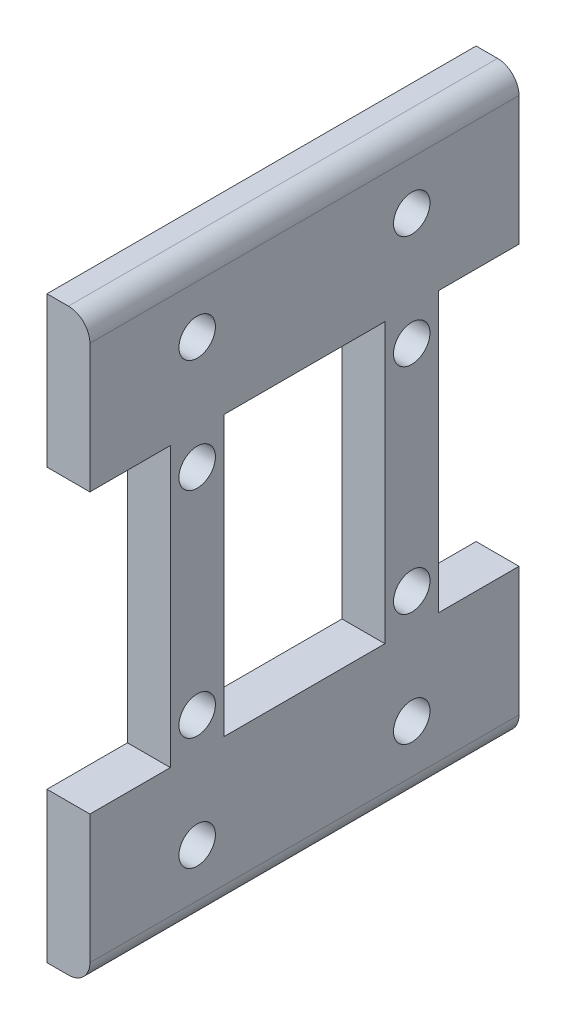
ISO-10303-21;
HEADER;
FILE_DESCRIPTION(('STEP AP214'),'2;1');
FILE_NAME('part.step','',(''),(''),'','','');
FILE_SCHEMA(('AUTOMOTIVE_DESIGN { 1 0 10303 214 1 1 1 1 }'));
ENDSEC;
DATA;
#1=APPLICATION_CONTEXT('core data for automotive mechanical design processes');
#2=APPLICATION_PROTOCOL_DEFINITION('international standard','automotive_design',2000,#1);
#3=PRODUCT_CONTEXT('',#1,'mechanical');
#4=PRODUCT('Part','Part','',(#3));
#5=PRODUCT_RELATED_PRODUCT_CATEGORY('part','',(#4));
#6=PRODUCT_DEFINITION_FORMATION('','',#4);
#7=PRODUCT_DEFINITION_CONTEXT('part definition',#1,'design');
#8=PRODUCT_DEFINITION('design','',#6,#7);
#9=PRODUCT_DEFINITION_SHAPE('','',#8);
#10=(LENGTH_UNIT() NAMED_UNIT(*) SI_UNIT(.MILLI.,.METRE.));
#11=(NAMED_UNIT(*) PLANE_ANGLE_UNIT() SI_UNIT($,.RADIAN.));
#12=(NAMED_UNIT(*) SI_UNIT($,.STERADIAN.) SOLID_ANGLE_UNIT());
#13=UNCERTAINTY_MEASURE_WITH_UNIT(LENGTH_MEASURE(1.E-05),#10,'distance_accuracy_value','');
#14=(GEOMETRIC_REPRESENTATION_CONTEXT(3) GLOBAL_UNCERTAINTY_ASSIGNED_CONTEXT((#13)) GLOBAL_UNIT_ASSIGNED_CONTEXT((#10,
#11,#12)) REPRESENTATION_CONTEXT('',''));
#15=CARTESIAN_POINT('',(0.,0.,0.));
#16=DIRECTION('',(0.,0.,1.));
#17=DIRECTION('',(1.,0.,0.));
#18=AXIS2_PLACEMENT_3D('',#15,#16,#17);
#19=CARTESIAN_POINT('',(-28.4226569673589,19.6378058506293,-42.091224183858));
#20=DIRECTION('',(-1.,0.,0.));
#21=DIRECTION('',(0.,0.,1.));
#22=AXIS2_PLACEMENT_3D('',#19,#20,#21);
#23=PLANE('',#22);
#24=DIRECTION('',(0.,0.,-1.));
#25=VECTOR('',#24,1.);
#26=CARTESIAN_POINT('',(-28.4226569673589,-26.0821941493707,15.068775816142));
#27=LINE('',#26,#25);
#28=CARTESIAN_POINT('',(-28.4226569673589,-26.0821941493707,-0.80622418385801));
#29=VERTEX_POINT('',#28);
#30=CARTESIAN_POINT('',(-28.4226569673589,-26.0821941493707,-19.856224183858));
#31=VERTEX_POINT('',#30);
#32=EDGE_CURVE('E250',#29,#31,#27,.T.);
#33=ORIENTED_EDGE('',*,*,#32,.F.);
#34=DIRECTION('',(0.,-1.,0.));
#35=VECTOR('',#34,1.);
#36=CARTESIAN_POINT('',(-28.4226569673589,12.0178058506293,-0.806224183858015));
#37=LINE('',#36,#35);
#38=CARTESIAN_POINT('',(-28.4226569673589,6.93780585062928,-0.806224183858017));
#39=VERTEX_POINT('',#38);
#40=EDGE_CURVE('E285',#39,#29,#37,.T.);
#41=ORIENTED_EDGE('',*,*,#40,.F.);
#42=DIRECTION('',(0.,0.,1.));
#43=VECTOR('',#42,1.);
#44=CARTESIAN_POINT('',(-28.4226569673589,6.93780585062928,15.068775816142));
#45=LINE('',#44,#43);
#46=CARTESIAN_POINT('',(-28.4226569673589,6.93780585062928,-19.856224183858));
#47=VERTEX_POINT('',#46);
#48=EDGE_CURVE('E192',#47,#39,#45,.T.);
#49=ORIENTED_EDGE('',*,*,#48,.F.);
#50=DIRECTION('',(0.,1.,0.));
#51=VECTOR('',#50,1.);
#52=CARTESIAN_POINT('',(-28.4226569673589,-31.1621941493707,-19.856224183858));
#53=LINE('',#52,#51);
#54=EDGE_CURVE('E294',#31,#47,#53,.T.);
#55=ORIENTED_EDGE('',*,*,#54,.F.);
#56=EDGE_LOOP('',(#33,#41,#49,#55));
#57=FACE_BOUND('',#56,.T.);
#58=CARTESIAN_POINT('',(-28.4226569673589,-35.6071941493707,-23.031224183858));
#59=DIRECTION('',(-1.,0.,0.));
#60=DIRECTION('',(0.,0.,1.));
#61=AXIS2_PLACEMENT_3D('',#58,#59,#60);
#62=CIRCLE('',#61,2.159);
#63=CARTESIAN_POINT('',(-28.4226569673589,-35.6071941493707,-20.872224183858));
#64=VERTEX_POINT('',#63);
#65=EDGE_CURVE('E245',#64,#64,#62,.F.);
#66=ORIENTED_EDGE('',*,*,#65,.F.);
#67=EDGE_LOOP('',(#66));
#68=FACE_BOUND('',#67,.T.);
#69=CARTESIAN_POINT('',(-28.4226569673589,-35.6071941493707,2.36877581614199));
#70=DIRECTION('',(-1.,0.,0.));
#71=DIRECTION('',(0.,0.,1.));
#72=AXIS2_PLACEMENT_3D('',#69,#70,#71);
#73=CIRCLE('',#72,2.159);
#74=CARTESIAN_POINT('',(-28.4226569673589,-35.6071941493707,4.527775816142));
#75=VERTEX_POINT('',#74);
#76=EDGE_CURVE('E241',#75,#75,#73,.F.);
#77=ORIENTED_EDGE('',*,*,#76,.F.);
#78=EDGE_LOOP('',(#77));
#79=FACE_BOUND('',#78,.T.);
#80=CARTESIAN_POINT('',(-28.4226569673589,-26.0821941493707,15.068775816142));
#81=VERTEX_POINT('',#80);
#82=CARTESIAN_POINT('',(-28.4226569673589,-26.0821941493707,5.54377581614199));
#83=VERTEX_POINT('',#82);
#84=EDGE_CURVE('E191',#81,#83,#27,.T.);
#85=ORIENTED_EDGE('',*,*,#84,.F.);
#86=DIRECTION('',(0.,-1.,0.));
#87=VECTOR('',#86,1.);
#88=CARTESIAN_POINT('',(-28.4226569673589,-31.1621941493707,15.068775816142));
#89=LINE('',#88,#87);
#90=CARTESIAN_POINT('',(-28.4226569673589,-41.3221941493707,15.068775816142));
#91=VERTEX_POINT('',#90);
#92=EDGE_CURVE('E260',#81,#91,#89,.T.);
#93=ORIENTED_EDGE('',*,*,#92,.T.);
#94=DIRECTION('',(0.,0.,-1.));
#95=VECTOR('',#94,1.);
#96=CARTESIAN_POINT('',(-28.4226569673589,-41.3221941493707,-35.731224183858));
#97=LINE('',#96,#95);
#98=CARTESIAN_POINT('',(-28.4226569673589,-41.3221941493707,-35.731224183858));
#99=VERTEX_POINT('',#98);
#100=EDGE_CURVE('E358',#91,#99,#97,.T.);
#101=ORIENTED_EDGE('',*,*,#100,.T.);
#102=DIRECTION('',(0.,1.,0.));
#103=VECTOR('',#102,1.);
#104=CARTESIAN_POINT('',(-28.4226569673589,-43.8621941493707,-35.731224183858));
#105=LINE('',#104,#103);
#106=CARTESIAN_POINT('',(-28.4226569673589,-26.0821941493707,-35.731224183858));
#107=VERTEX_POINT('',#106);
#108=EDGE_CURVE('E330',#99,#107,#105,.T.);
#109=ORIENTED_EDGE('',*,*,#108,.T.);
#110=CARTESIAN_POINT('',(-28.4226569673589,-26.0821941493707,-26.206224183858));
#111=VERTEX_POINT('',#110);
#112=EDGE_CURVE('E71',#111,#107,#27,.T.);
#113=ORIENTED_EDGE('',*,*,#112,.F.);
#114=DIRECTION('',(0.,1.,0.));
#115=VECTOR('',#114,1.);
#116=CARTESIAN_POINT('',(-28.4226569673589,-31.1621941493707,-26.206224183858));
#117=LINE('',#116,#115);
#118=CARTESIAN_POINT('',(-28.4226569673589,6.93780585062928,-26.206224183858));
#119=VERTEX_POINT('',#118);
#120=EDGE_CURVE('E332',#111,#119,#117,.T.);
#121=ORIENTED_EDGE('',*,*,#120,.T.);
#122=CARTESIAN_POINT('',(-28.4226569673589,6.93780585062928,-35.731224183858));
#123=VERTEX_POINT('',#122);
#124=EDGE_CURVE('E194',#123,#119,#45,.T.);
#125=ORIENTED_EDGE('',*,*,#124,.F.);
#126=DIRECTION('',(0.,1.,0.));
#127=VECTOR('',#126,1.);
#128=CARTESIAN_POINT('',(-28.4226569673589,12.0178058506293,-35.731224183858));
#129=LINE('',#128,#127);
#130=CARTESIAN_POINT('',(-28.4226569673589,22.1778058506293,-35.731224183858));
#131=VERTEX_POINT('',#130);
#132=EDGE_CURVE('E334',#123,#131,#129,.T.);
#133=ORIENTED_EDGE('',*,*,#132,.T.);
#134=DIRECTION('',(0.,0.,1.));
#135=VECTOR('',#134,1.);
#136=CARTESIAN_POINT('',(-28.4226569673589,22.1778058506293,15.068775816142));
#137=LINE('',#136,#135);
#138=CARTESIAN_POINT('',(-28.4226569673589,22.1778058506293,15.068775816142));
#139=VERTEX_POINT('',#138);
#140=EDGE_CURVE('E178',#131,#139,#137,.T.);
#141=ORIENTED_EDGE('',*,*,#140,.T.);
#142=DIRECTION('',(0.,-1.,0.));
#143=VECTOR('',#142,1.);
#144=CARTESIAN_POINT('',(-28.4226569673589,24.7178058506293,15.068775816142));
#145=LINE('',#144,#143);
#146=CARTESIAN_POINT('',(-28.4226569673589,6.93780585062928,15.068775816142));
#147=VERTEX_POINT('',#146);
#148=EDGE_CURVE('E174',#139,#147,#145,.T.);
#149=ORIENTED_EDGE('',*,*,#148,.T.);
#150=CARTESIAN_POINT('',(-28.4226569673589,6.93780585062928,5.54377581614199));
#151=VERTEX_POINT('',#150);
#152=EDGE_CURVE('E64',#151,#147,#45,.T.);
#153=ORIENTED_EDGE('',*,*,#152,.F.);
#154=DIRECTION('',(0.,-1.,0.));
#155=VECTOR('',#154,1.);
#156=CARTESIAN_POINT('',(-28.4226569673589,12.0178058506293,5.54377581614199));
#157=LINE('',#156,#155);
#158=EDGE_CURVE('E182',#151,#83,#157,.T.);
#159=ORIENTED_EDGE('',*,*,#158,.T.);
#160=EDGE_LOOP('',(#85,#93,#101,#109,#113,#121,#125,#133,#141,#149,#153,#159));
#161=FACE_BOUND('',#160,.T.);
#162=CARTESIAN_POINT('',(-28.4226569673589,16.4628058506293,2.36877581614198));
#163=DIRECTION('',(-1.,0.,0.));
#164=DIRECTION('',(0.,0.,1.));
#165=AXIS2_PLACEMENT_3D('',#162,#163,#164);
#166=CIRCLE('',#165,2.159);
#167=CARTESIAN_POINT('',(-28.4226569673589,16.4628058506293,4.52777581614198));
#168=VERTEX_POINT('',#167);
#169=EDGE_CURVE('E248',#168,#168,#166,.F.);
#170=ORIENTED_EDGE('',*,*,#169,.F.);
#171=EDGE_LOOP('',(#170));
#172=FACE_BOUND('',#171,.T.);
#173=CARTESIAN_POINT('',(-28.4226569673589,16.4628058506293,-23.031224183858));
#174=DIRECTION('',(-1.,0.,0.));
#175=DIRECTION('',(0.,0.,1.));
#176=AXIS2_PLACEMENT_3D('',#173,#174,#175);
#177=CIRCLE('',#176,2.159);
#178=CARTESIAN_POINT('',(-28.4226569673589,16.4628058506293,-20.872224183858));
#179=VERTEX_POINT('',#178);
#180=EDGE_CURVE('E376',#179,#179,#177,.F.);
#181=ORIENTED_EDGE('',*,*,#180,.F.);
#182=EDGE_LOOP('',(#181));
#183=FACE_BOUND('',#182,.T.);
#184=CARTESIAN_POINT('',(-28.4226569673589,-22.2721941493707,2.36877581614199));
#185=DIRECTION('',(1.,0.,0.));
#186=DIRECTION('',(0.,0.,-1.));
#187=AXIS2_PLACEMENT_3D('',#184,#185,#186);
#188=CIRCLE('',#187,2.159);
#189=CARTESIAN_POINT('',(-28.4226569673589,-22.2721941493707,0.209775816141987));
#190=VERTEX_POINT('',#189);
#191=EDGE_CURVE('E303',#190,#190,#188,.T.);
#192=ORIENTED_EDGE('',*,*,#191,.F.);
#193=EDGE_LOOP('',(#192));
#194=FACE_BOUND('',#193,.T.);
#195=CARTESIAN_POINT('',(-28.4226569673589,3.12780585062929,2.36877581614198));
#196=DIRECTION('',(1.,0.,0.));
#197=DIRECTION('',(0.,0.,-1.));
#198=AXIS2_PLACEMENT_3D('',#195,#196,#197);
#199=CIRCLE('',#198,2.159);
#200=CARTESIAN_POINT('',(-28.4226569673589,3.12780585062929,0.209775816141984));
#201=VERTEX_POINT('',#200);
#202=EDGE_CURVE('E322',#201,#201,#199,.T.);
#203=ORIENTED_EDGE('',*,*,#202,.F.);
#204=EDGE_LOOP('',(#203));
#205=FACE_BOUND('',#204,.T.);
#206=CARTESIAN_POINT('',(-28.4226569673589,-22.2721941493707,-23.031224183858));
#207=DIRECTION('',(1.,0.,0.));
#208=DIRECTION('',(0.,0.,-1.));
#209=AXIS2_PLACEMENT_3D('',#206,#207,#208);
#210=CIRCLE('',#209,2.159);
#211=CARTESIAN_POINT('',(-28.4226569673589,-22.2721941493707,-25.190224183858));
#212=VERTEX_POINT('',#211);
#213=EDGE_CURVE('E310',#212,#212,#210,.T.);
#214=ORIENTED_EDGE('',*,*,#213,.F.);
#215=EDGE_LOOP('',(#214));
#216=FACE_BOUND('',#215,.T.);
#217=CARTESIAN_POINT('',(-28.4226569673589,3.12780585062927,-23.031224183858));
#218=DIRECTION('',(1.,0.,0.));
#219=DIRECTION('',(0.,0.,-1.));
#220=AXIS2_PLACEMENT_3D('',#217,#218,#219);
#221=CIRCLE('',#220,2.159);
#222=CARTESIAN_POINT('',(-28.4226569673589,3.12780585062927,-25.190224183858));
#223=VERTEX_POINT('',#222);
#224=EDGE_CURVE('E316',#223,#223,#221,.T.);
#225=ORIENTED_EDGE('',*,*,#224,.F.);
#226=EDGE_LOOP('',(#225));
#227=FACE_BOUND('',#226,.T.);
#228=ADVANCED_FACE('F47',(#57,#68,#79,#161,#172,#183,#194,#205,#216,#227),#23,.F.);
#229=CARTESIAN_POINT('',(-28.4226569673589,-43.8621941493707,15.068775816142));
#230=DIRECTION('',(0.,1.,0.));
#231=DIRECTION('',(0.,0.,1.));
#232=AXIS2_PLACEMENT_3D('',#229,#230,#231);
#233=PLANE('',#232);
#234=DIRECTION('',(-1.,0.,0.));
#235=VECTOR('',#234,1.);
#236=CARTESIAN_POINT('',(-28.4226569673589,-43.8621941493707,-35.731224183858));
#237=LINE('',#236,#235);
#238=CARTESIAN_POINT('',(-30.9626569673589,-43.8621941493707,-35.731224183858));
#239=VERTEX_POINT('',#238);
#240=CARTESIAN_POINT('',(-33.5026569673589,-43.8621941493707,-35.731224183858));
#241=VERTEX_POINT('',#240);
#242=EDGE_CURVE('E350',#239,#241,#237,.T.);
#243=ORIENTED_EDGE('',*,*,#242,.F.);
#244=DIRECTION('',(0.,0.,-1.));
#245=VECTOR('',#244,1.);
#246=CARTESIAN_POINT('',(-30.9626569673589,-43.8621941493707,15.068775816142));
#247=LINE('',#246,#245);
#248=CARTESIAN_POINT('',(-30.9626569673589,-43.8621941493707,15.068775816142));
#249=VERTEX_POINT('',#248);
#250=EDGE_CURVE('E371',#239,#249,#247,.F.);
#251=ORIENTED_EDGE('',*,*,#250,.T.);
#252=DIRECTION('',(-1.,0.,0.));
#253=VECTOR('',#252,1.);
#254=CARTESIAN_POINT('',(-28.4226569673589,-43.8621941493707,15.068775816142));
#255=LINE('',#254,#253);
#256=CARTESIAN_POINT('',(-33.5026569673589,-43.8621941493707,15.068775816142));
#257=VERTEX_POINT('',#256);
#258=EDGE_CURVE('E352',#249,#257,#255,.T.);
#259=ORIENTED_EDGE('',*,*,#258,.T.);
#260=DIRECTION('',(0.,0.,-1.));
#261=VECTOR('',#260,1.);
#262=CARTESIAN_POINT('',(-33.5026569673589,-43.8621941493707,15.068775816142));
#263=LINE('',#262,#261);
#264=EDGE_CURVE('E272',#257,#241,#263,.T.);
#265=ORIENTED_EDGE('',*,*,#264,.T.);
#266=EDGE_LOOP('',(#243,#251,#259,#265));
#267=FACE_BOUND('',#266,.T.);
#268=ADVANCED_FACE('F411',(#267),#233,.F.);
#269=CARTESIAN_POINT('',(-28.4226569673589,24.7178058506293,-35.731224183858));
#270=DIRECTION('',(0.,-1.,0.));
#271=DIRECTION('',(0.,0.,-1.));
#272=AXIS2_PLACEMENT_3D('',#269,#270,#271);
#273=PLANE('',#272);
#274=DIRECTION('',(-1.,0.,0.));
#275=VECTOR('',#274,1.);
#276=CARTESIAN_POINT('',(-28.4226569673589,24.7178058506293,15.068775816142));
#277=LINE('',#276,#275);
#278=CARTESIAN_POINT('',(-30.9626569673589,24.7178058506293,15.068775816142));
#279=VERTEX_POINT('',#278);
#280=CARTESIAN_POINT('',(-33.5026569673589,24.7178058506293,15.068775816142));
#281=VERTEX_POINT('',#280);
#282=EDGE_CURVE('E354',#279,#281,#277,.T.);
#283=ORIENTED_EDGE('',*,*,#282,.F.);
#284=DIRECTION('',(0.,0.,1.));
#285=VECTOR('',#284,1.);
#286=CARTESIAN_POINT('',(-30.9626569673589,24.7178058506293,-35.731224183858));
#287=LINE('',#286,#285);
#288=CARTESIAN_POINT('',(-30.9626569673589,24.7178058506293,-35.731224183858));
#289=VERTEX_POINT('',#288);
#290=EDGE_CURVE('E364',#279,#289,#287,.F.);
#291=ORIENTED_EDGE('',*,*,#290,.T.);
#292=DIRECTION('',(-1.,0.,0.));
#293=VECTOR('',#292,1.);
#294=CARTESIAN_POINT('',(-28.4226569673589,24.7178058506293,-35.731224183858));
#295=LINE('',#294,#293);
#296=CARTESIAN_POINT('',(-33.5026569673589,24.7178058506293,-35.731224183858));
#297=VERTEX_POINT('',#296);
#298=EDGE_CURVE('E336',#289,#297,#295,.T.);
#299=ORIENTED_EDGE('',*,*,#298,.T.);
#300=DIRECTION('',(0.,0.,1.));
#301=VECTOR('',#300,1.);
#302=CARTESIAN_POINT('',(-33.5026569673589,24.7178058506293,-35.731224183858));
#303=LINE('',#302,#301);
#304=EDGE_CURVE('E325',#297,#281,#303,.T.);
#305=ORIENTED_EDGE('',*,*,#304,.T.);
#306=EDGE_LOOP('',(#283,#291,#299,#305));
#307=FACE_BOUND('',#306,.T.);
#308=ADVANCED_FACE('F417',(#307),#273,.F.);
#309=CARTESIAN_POINT('',(-30.9626569673589,22.1778058506293,-6.67265006535445));
#310=DIRECTION('',(0.,0.,-1.));
#311=DIRECTION('',(0.,1.,0.));
#312=AXIS2_PLACEMENT_3D('',#309,#310,#311);
#313=CYLINDRICAL_SURFACE('',#312,2.54);
#314=CARTESIAN_POINT('',(-30.9626569673589,22.1778058506293,-35.731224183858));
#315=DIRECTION('',(0.,0.,1.));
#316=DIRECTION('',(1.,0.,0.));
#317=AXIS2_PLACEMENT_3D('',#314,#315,#316);
#318=CIRCLE('',#317,2.54);
#319=EDGE_CURVE('E366',#289,#131,#318,.F.);
#320=ORIENTED_EDGE('',*,*,#319,.F.);
#321=ORIENTED_EDGE('',*,*,#290,.F.);
#322=CARTESIAN_POINT('',(-30.9626569673589,22.1778058506293,15.068775816142));
#323=DIRECTION('',(0.,0.,-1.));
#324=DIRECTION('',(-1.,0.,0.));
#325=AXIS2_PLACEMENT_3D('',#322,#323,#324);
#326=CIRCLE('',#325,2.54);
#327=EDGE_CURVE('E362',#139,#279,#326,.F.);
#328=ORIENTED_EDGE('',*,*,#327,.F.);
#329=ORIENTED_EDGE('',*,*,#140,.F.);
#330=EDGE_LOOP('',(#320,#321,#328,#329));
#331=FACE_BOUND('',#330,.T.);
#332=ADVANCED_FACE('F599',(#331),#313,.T.);
#333=CARTESIAN_POINT('',(-28.4226569673589,12.0178058506293,-35.731224183858));
#334=DIRECTION('',(0.,0.,1.));
#335=DIRECTION('',(1.,0.,0.));
#336=AXIS2_PLACEMENT_3D('',#333,#334,#335);
#337=PLANE('',#336);
#338=ORIENTED_EDGE('',*,*,#132,.F.);
#339=DIRECTION('',(-1.,0.,0.));
#340=VECTOR('',#339,1.);
#341=CARTESIAN_POINT('',(-28.4226569673589,6.93780585062928,-35.731224183858));
#342=LINE('',#341,#340);
#343=CARTESIAN_POINT('',(-33.5026569673589,6.93780585062928,-35.731224183858));
#344=VERTEX_POINT('',#343);
#345=EDGE_CURVE('E199',#123,#344,#342,.T.);
#346=ORIENTED_EDGE('',*,*,#345,.T.);
#347=DIRECTION('',(0.,1.,0.));
#348=VECTOR('',#347,1.);
#349=CARTESIAN_POINT('',(-33.5026569673589,12.0178058506293,-35.731224183858));
#350=LINE('',#349,#348);
#351=EDGE_CURVE('E181',#344,#297,#350,.T.);
#352=ORIENTED_EDGE('',*,*,#351,.T.);
#353=ORIENTED_EDGE('',*,*,#298,.F.);
#354=ORIENTED_EDGE('',*,*,#319,.T.);
#355=EDGE_LOOP('',(#338,#346,#352,#353,#354));
#356=FACE_BOUND('',#355,.T.);
#357=ADVANCED_FACE('F590',(#356),#337,.F.);
#358=CARTESIAN_POINT('',(-28.4226569673589,24.7178058506293,15.068775816142));
#359=DIRECTION('',(0.,0.,-1.));
#360=DIRECTION('',(-1.,0.,0.));
#361=AXIS2_PLACEMENT_3D('',#358,#359,#360);
#362=PLANE('',#361);
#363=DIRECTION('',(-1.,0.,0.));
#364=VECTOR('',#363,1.);
#365=CARTESIAN_POINT('',(-28.4226569673589,6.93780585062928,15.068775816142));
#366=LINE('',#365,#364);
#367=CARTESIAN_POINT('',(-33.5026569673589,6.93780585062928,15.068775816142));
#368=VERTEX_POINT('',#367);
#369=EDGE_CURVE('E51',#147,#368,#366,.T.);
#370=ORIENTED_EDGE('',*,*,#369,.F.);
#371=ORIENTED_EDGE('',*,*,#148,.F.);
#372=ORIENTED_EDGE('',*,*,#327,.T.);
#373=ORIENTED_EDGE('',*,*,#282,.T.);
#374=DIRECTION('',(0.,-1.,0.));
#375=VECTOR('',#374,1.);
#376=CARTESIAN_POINT('',(-33.5026569673589,24.7178058506293,15.068775816142));
#377=LINE('',#376,#375);
#378=EDGE_CURVE('E197',#281,#368,#377,.T.);
#379=ORIENTED_EDGE('',*,*,#378,.T.);
#380=EDGE_LOOP('',(#370,#371,#372,#373,#379));
#381=FACE_BOUND('',#380,.T.);
#382=ADVANCED_FACE('F195',(#381),#362,.F.);
#383=CARTESIAN_POINT('',(-28.4226569673589,12.0178058506293,5.54377581614199));
#384=DIRECTION('',(0.,0.,-1.));
#385=DIRECTION('',(0.,1.,0.));
#386=AXIS2_PLACEMENT_3D('',#383,#384,#385);
#387=PLANE('',#386);
#388=DIRECTION('',(-1.,0.,0.));
#389=VECTOR('',#388,1.);
#390=CARTESIAN_POINT('',(-28.4226569673589,-26.0821941493707,5.54377581614199));
#391=LINE('',#390,#389);
#392=CARTESIAN_POINT('',(-33.5026569673589,-26.0821941493707,5.54377581614199));
#393=VERTEX_POINT('',#392);
#394=EDGE_CURVE('E216',#83,#393,#391,.T.);
#395=ORIENTED_EDGE('',*,*,#394,.F.);
#396=ORIENTED_EDGE('',*,*,#158,.F.);
#397=DIRECTION('',(1.,0.,0.));
#398=VECTOR('',#397,1.);
#399=CARTESIAN_POINT('',(-28.4226569673589,6.93780585062928,5.54377581614199));
#400=LINE('',#399,#398);
#401=CARTESIAN_POINT('',(-33.5026569673589,6.93780585062928,5.54377581614199));
#402=VERTEX_POINT('',#401);
#403=EDGE_CURVE('E189',#402,#151,#400,.T.);
#404=ORIENTED_EDGE('',*,*,#403,.F.);
#405=DIRECTION('',(0.,-1.,0.));
#406=VECTOR('',#405,1.);
#407=CARTESIAN_POINT('',(-33.5026569673589,12.0178058506293,5.54377581614199));
#408=LINE('',#407,#406);
#409=EDGE_CURVE('E273',#402,#393,#408,.T.);
#410=ORIENTED_EDGE('',*,*,#409,.T.);
#411=EDGE_LOOP('',(#395,#396,#404,#410));
#412=FACE_BOUND('',#411,.T.);
#413=ADVANCED_FACE('F460',(#412),#387,.F.);
#414=CARTESIAN_POINT('',(-33.5026569673589,-37.4439935173894,-6.67265006535445));
#415=DIRECTION('',(1.,0.,0.));
#416=DIRECTION('',(0.,0.,-1.));
#417=AXIS2_PLACEMENT_3D('',#414,#415,#416);
#418=PLANE('',#417);
#419=CARTESIAN_POINT('',(-33.5026569673589,-35.6071941493707,2.36877581614199));
#420=DIRECTION('',(1.,0.,0.));
#421=DIRECTION('',(0.,0.,-1.));
#422=AXIS2_PLACEMENT_3D('',#419,#420,#421);
#423=CIRCLE('',#422,2.159);
#424=CARTESIAN_POINT('',(-33.5026569673589,-35.6071941493707,0.209775816141994));
#425=VERTEX_POINT('',#424);
#426=EDGE_CURVE('E56',#425,#425,#423,.T.);
#427=ORIENTED_EDGE('',*,*,#426,.T.);
#428=EDGE_LOOP('',(#427));
#429=FACE_BOUND('',#428,.T.);
#430=CARTESIAN_POINT('',(-33.5026569673589,-35.6071941493707,-23.031224183858));
#431=DIRECTION('',(1.,0.,0.));
#432=DIRECTION('',(0.,0.,-1.));
#433=AXIS2_PLACEMENT_3D('',#430,#431,#432);
#434=CIRCLE('',#433,2.159);
#435=CARTESIAN_POINT('',(-33.5026569673589,-35.6071941493707,-25.190224183858));
#436=VERTEX_POINT('',#435);
#437=EDGE_CURVE('E11',#436,#436,#434,.T.);
#438=ORIENTED_EDGE('',*,*,#437,.T.);
#439=EDGE_LOOP('',(#438));
#440=FACE_BOUND('',#439,.T.);
#441=CARTESIAN_POINT('',(-33.5026569673589,16.4628058506293,2.36877581614198));
#442=DIRECTION('',(1.,0.,0.));
#443=DIRECTION('',(0.,0.,-1.));
#444=AXIS2_PLACEMENT_3D('',#441,#442,#443);
#445=CIRCLE('',#444,2.159);
#446=CARTESIAN_POINT('',(-33.5026569673589,16.4628058506293,0.209775816141981));
#447=VERTEX_POINT('',#446);
#448=EDGE_CURVE('E236',#447,#447,#445,.T.);
#449=ORIENTED_EDGE('',*,*,#448,.T.);
#450=EDGE_LOOP('',(#449));
#451=FACE_BOUND('',#450,.T.);
#452=CARTESIAN_POINT('',(-33.5026569673589,16.4628058506293,-23.031224183858));
#453=DIRECTION('',(1.,0.,0.));
#454=DIRECTION('',(0.,0.,-1.));
#455=AXIS2_PLACEMENT_3D('',#452,#453,#454);
#456=CIRCLE('',#455,2.159);
#457=CARTESIAN_POINT('',(-33.5026569673589,16.4628058506293,-25.190224183858));
#458=VERTEX_POINT('',#457);
#459=EDGE_CURVE('E233',#458,#458,#456,.T.);
#460=ORIENTED_EDGE('',*,*,#459,.T.);
#461=EDGE_LOOP('',(#460));
#462=FACE_BOUND('',#461,.T.);
#463=ORIENTED_EDGE('',*,*,#304,.F.);
#464=ORIENTED_EDGE('',*,*,#351,.F.);
#465=DIRECTION('',(0.,0.,-1.));
#466=VECTOR('',#465,1.);
#467=CARTESIAN_POINT('',(-33.5026569673589,6.93780585062928,15.068775816142));
#468=LINE('',#467,#466);
#469=CARTESIAN_POINT('',(-33.5026569673589,6.93780585062928,-26.206224183858));
#470=VERTEX_POINT('',#469);
#471=EDGE_CURVE('E215',#470,#344,#468,.T.);
#472=ORIENTED_EDGE('',*,*,#471,.F.);
#473=DIRECTION('',(0.,1.,0.));
#474=VECTOR('',#473,1.);
#475=CARTESIAN_POINT('',(-33.5026569673589,-31.1621941493707,-26.206224183858));
#476=LINE('',#475,#474);
#477=CARTESIAN_POINT('',(-33.5026569673589,-26.0821941493707,-26.206224183858));
#478=VERTEX_POINT('',#477);
#479=EDGE_CURVE('E345',#478,#470,#476,.T.);
#480=ORIENTED_EDGE('',*,*,#479,.F.);
#481=DIRECTION('',(0.,0.,1.));
#482=VECTOR('',#481,1.);
#483=CARTESIAN_POINT('',(-33.5026569673589,-26.0821941493707,15.068775816142));
#484=LINE('',#483,#482);
#485=CARTESIAN_POINT('',(-33.5026569673589,-26.0821941493707,-35.731224183858));
#486=VERTEX_POINT('',#485);
#487=EDGE_CURVE('E227',#486,#478,#484,.T.);
#488=ORIENTED_EDGE('',*,*,#487,.F.);
#489=DIRECTION('',(0.,1.,0.));
#490=VECTOR('',#489,1.);
#491=CARTESIAN_POINT('',(-33.5026569673589,-43.8621941493707,-35.731224183858));
#492=LINE('',#491,#490);
#493=EDGE_CURVE('E342',#241,#486,#492,.T.);
#494=ORIENTED_EDGE('',*,*,#493,.F.);
#495=ORIENTED_EDGE('',*,*,#264,.F.);
#496=DIRECTION('',(0.,-1.,0.));
#497=VECTOR('',#496,1.);
#498=CARTESIAN_POINT('',(-33.5026569673589,-31.1621941493707,15.068775816142));
#499=LINE('',#498,#497);
#500=CARTESIAN_POINT('',(-33.5026569673589,-26.0821941493707,15.068775816142));
#501=VERTEX_POINT('',#500);
#502=EDGE_CURVE('E257',#501,#257,#499,.T.);
#503=ORIENTED_EDGE('',*,*,#502,.F.);
#504=EDGE_CURVE('E232',#393,#501,#484,.T.);
#505=ORIENTED_EDGE('',*,*,#504,.F.);
#506=ORIENTED_EDGE('',*,*,#409,.F.);
#507=EDGE_CURVE('E201',#368,#402,#468,.T.);
#508=ORIENTED_EDGE('',*,*,#507,.F.);
#509=ORIENTED_EDGE('',*,*,#378,.F.);
#510=EDGE_LOOP('',(#463,#464,#472,#480,#488,#494,#495,#503,#505,#506,#508,#509));
#511=FACE_BOUND('',#510,.T.);
#512=DIRECTION('',(0.,1.,0.));
#513=VECTOR('',#512,1.);
#514=CARTESIAN_POINT('',(-33.5026569673589,-31.1621941493707,-19.856224183858));
#515=LINE('',#514,#513);
#516=CARTESIAN_POINT('',(-33.5026569673589,-26.0821941493707,-19.856224183858));
#517=VERTEX_POINT('',#516);
#518=CARTESIAN_POINT('',(-33.5026569673589,6.93780585062928,-19.856224183858));
#519=VERTEX_POINT('',#518);
#520=EDGE_CURVE('E289',#517,#519,#515,.T.);
#521=ORIENTED_EDGE('',*,*,#520,.T.);
#522=CARTESIAN_POINT('',(-33.5026569673589,6.93780585062928,-0.806224183858017));
#523=VERTEX_POINT('',#522);
#524=EDGE_CURVE('E214',#523,#519,#468,.T.);
#525=ORIENTED_EDGE('',*,*,#524,.F.);
#526=DIRECTION('',(0.,-1.,0.));
#527=VECTOR('',#526,1.);
#528=CARTESIAN_POINT('',(-33.5026569673589,12.0178058506293,-0.806224183858015));
#529=LINE('',#528,#527);
#530=CARTESIAN_POINT('',(-33.5026569673589,-26.0821941493707,-0.80622418385801));
#531=VERTEX_POINT('',#530);
#532=EDGE_CURVE('E284',#523,#531,#529,.T.);
#533=ORIENTED_EDGE('',*,*,#532,.T.);
#534=EDGE_CURVE('E230',#517,#531,#484,.T.);
#535=ORIENTED_EDGE('',*,*,#534,.F.);
#536=EDGE_LOOP('',(#521,#525,#533,#535));
#537=FACE_BOUND('',#536,.T.);
#538=CARTESIAN_POINT('',(-33.5026569673589,3.12780585062929,2.36877581614198));
#539=DIRECTION('',(1.,0.,0.));
#540=DIRECTION('',(0.,0.,-1.));
#541=AXIS2_PLACEMENT_3D('',#538,#539,#540);
#542=CIRCLE('',#541,2.159);
#543=CARTESIAN_POINT('',(-33.5026569673589,3.12780585062929,0.209775816141984));
#544=VERTEX_POINT('',#543);
#545=EDGE_CURVE('E319',#544,#544,#542,.T.);
#546=ORIENTED_EDGE('',*,*,#545,.T.);
#547=EDGE_LOOP('',(#546));
#548=FACE_BOUND('',#547,.T.);
#549=CARTESIAN_POINT('',(-33.5026569673589,3.12780585062927,-23.031224183858));
#550=DIRECTION('',(1.,0.,0.));
#551=DIRECTION('',(0.,0.,-1.));
#552=AXIS2_PLACEMENT_3D('',#549,#550,#551);
#553=CIRCLE('',#552,2.159);
#554=CARTESIAN_POINT('',(-33.5026569673589,3.12780585062927,-25.190224183858));
#555=VERTEX_POINT('',#554);
#556=EDGE_CURVE('E313',#555,#555,#553,.T.);
#557=ORIENTED_EDGE('',*,*,#556,.T.);
#558=EDGE_LOOP('',(#557));
#559=FACE_BOUND('',#558,.T.);
#560=CARTESIAN_POINT('',(-33.5026569673589,-22.2721941493707,-23.031224183858));
#561=DIRECTION('',(1.,0.,0.));
#562=DIRECTION('',(0.,0.,-1.));
#563=AXIS2_PLACEMENT_3D('',#560,#561,#562);
#564=CIRCLE('',#563,2.159);
#565=CARTESIAN_POINT('',(-33.5026569673589,-22.2721941493707,-25.190224183858));
#566=VERTEX_POINT('',#565);
#567=EDGE_CURVE('E308',#566,#566,#564,.T.);
#568=ORIENTED_EDGE('',*,*,#567,.T.);
#569=EDGE_LOOP('',(#568));
#570=FACE_BOUND('',#569,.T.);
#571=CARTESIAN_POINT('',(-33.5026569673589,-22.2721941493707,2.36877581614199));
#572=DIRECTION('',(1.,0.,0.));
#573=DIRECTION('',(0.,0.,-1.));
#574=AXIS2_PLACEMENT_3D('',#571,#572,#573);
#575=CIRCLE('',#574,2.159);
#576=CARTESIAN_POINT('',(-33.5026569673589,-22.2721941493707,0.209775816141987));
#577=VERTEX_POINT('',#576);
#578=EDGE_CURVE('E297',#577,#577,#575,.T.);
#579=ORIENTED_EDGE('',*,*,#578,.T.);
#580=EDGE_LOOP('',(#579));
#581=FACE_BOUND('',#580,.T.);
#582=ADVANCED_FACE('F267',(#429,#440,#451,#462,#511,#537,#548,#559,#570,#581),#418,.F.);
#583=CARTESIAN_POINT('',(-33.5026569673589,-35.6071941493707,2.36877581614199));
#584=DIRECTION('',(1.,0.,0.));
#585=DIRECTION('',(0.,0.,-1.));
#586=AXIS2_PLACEMENT_3D('',#583,#584,#585);
#587=CYLINDRICAL_SURFACE('',#586,2.159);
#588=ORIENTED_EDGE('',*,*,#76,.T.);
#589=EDGE_LOOP('',(#588));
#590=FACE_BOUND('',#589,.T.);
#591=ORIENTED_EDGE('',*,*,#426,.F.);
#592=EDGE_LOOP('',(#591));
#593=FACE_BOUND('',#592,.T.);
#594=ADVANCED_FACE('F459',(#590,#593),#587,.F.);
#595=CARTESIAN_POINT('',(-33.5026569673589,-35.6071941493707,-23.031224183858));
#596=DIRECTION('',(1.,0.,0.));
#597=DIRECTION('',(0.,0.,-1.));
#598=AXIS2_PLACEMENT_3D('',#595,#596,#597);
#599=CYLINDRICAL_SURFACE('',#598,2.159);
#600=ORIENTED_EDGE('',*,*,#65,.T.);
#601=EDGE_LOOP('',(#600));
#602=FACE_BOUND('',#601,.T.);
#603=ORIENTED_EDGE('',*,*,#437,.F.);
#604=EDGE_LOOP('',(#603));
#605=FACE_BOUND('',#604,.T.);
#606=ADVANCED_FACE('F468',(#602,#605),#599,.F.);
#607=CARTESIAN_POINT('',(-33.5026569673589,16.4628058506293,2.36877581614198));
#608=DIRECTION('',(1.,0.,0.));
#609=DIRECTION('',(0.,0.,-1.));
#610=AXIS2_PLACEMENT_3D('',#607,#608,#609);
#611=CYLINDRICAL_SURFACE('',#610,2.159);
#612=ORIENTED_EDGE('',*,*,#169,.T.);
#613=EDGE_LOOP('',(#612));
#614=FACE_BOUND('',#613,.T.);
#615=ORIENTED_EDGE('',*,*,#448,.F.);
#616=EDGE_LOOP('',(#615));
#617=FACE_BOUND('',#616,.T.);
#618=ADVANCED_FACE('F484',(#614,#617),#611,.F.);
#619=CARTESIAN_POINT('',(-33.5026569673589,16.4628058506293,-23.031224183858));
#620=DIRECTION('',(1.,0.,0.));
#621=DIRECTION('',(0.,0.,-1.));
#622=AXIS2_PLACEMENT_3D('',#619,#620,#621);
#623=CYLINDRICAL_SURFACE('',#622,2.159);
#624=ORIENTED_EDGE('',*,*,#180,.T.);
#625=EDGE_LOOP('',(#624));
#626=FACE_BOUND('',#625,.T.);
#627=ORIENTED_EDGE('',*,*,#459,.F.);
#628=EDGE_LOOP('',(#627));
#629=FACE_BOUND('',#628,.T.);
#630=ADVANCED_FACE('F481',(#626,#629),#623,.F.);
#631=CARTESIAN_POINT('',(-30.9626569673589,-41.3221941493707,-6.67265006535445));
#632=DIRECTION('',(0.,0.,1.));
#633=DIRECTION('',(0.,-1.,0.));
#634=AXIS2_PLACEMENT_3D('',#631,#632,#633);
#635=CYLINDRICAL_SURFACE('',#634,2.54);
#636=CARTESIAN_POINT('',(-30.9626569673589,-41.3221941493707,15.068775816142));
#637=DIRECTION('',(0.,0.,-1.));
#638=DIRECTION('',(-1.,0.,0.));
#639=AXIS2_PLACEMENT_3D('',#636,#637,#638);
#640=CIRCLE('',#639,2.54);
#641=EDGE_CURVE('E244',#249,#91,#640,.F.);
#642=ORIENTED_EDGE('',*,*,#641,.F.);
#643=ORIENTED_EDGE('',*,*,#250,.F.);
#644=CARTESIAN_POINT('',(-30.9626569673589,-41.3221941493707,-35.731224183858));
#645=DIRECTION('',(0.,0.,1.));
#646=DIRECTION('',(1.,0.,0.));
#647=AXIS2_PLACEMENT_3D('',#644,#645,#646);
#648=CIRCLE('',#647,2.54);
#649=EDGE_CURVE('E369',#99,#239,#648,.F.);
#650=ORIENTED_EDGE('',*,*,#649,.F.);
#651=ORIENTED_EDGE('',*,*,#100,.F.);
#652=EDGE_LOOP('',(#642,#643,#650,#651));
#653=FACE_BOUND('',#652,.T.);
#654=ADVANCED_FACE('F483',(#653),#635,.T.);
#655=CARTESIAN_POINT('',(-28.4226569673589,-31.1621941493707,15.068775816142));
#656=DIRECTION('',(0.,0.,-1.));
#657=DIRECTION('',(-1.,0.,0.));
#658=AXIS2_PLACEMENT_3D('',#655,#656,#657);
#659=PLANE('',#658);
#660=ORIENTED_EDGE('',*,*,#92,.F.);
#661=DIRECTION('',(-1.,0.,0.));
#662=VECTOR('',#661,1.);
#663=CARTESIAN_POINT('',(-28.4226569673589,-26.0821941493707,15.068775816142));
#664=LINE('',#663,#662);
#665=EDGE_CURVE('E231',#81,#501,#664,.T.);
#666=ORIENTED_EDGE('',*,*,#665,.T.);
#667=ORIENTED_EDGE('',*,*,#502,.T.);
#668=ORIENTED_EDGE('',*,*,#258,.F.);
#669=ORIENTED_EDGE('',*,*,#641,.T.);
#670=EDGE_LOOP('',(#660,#666,#667,#668,#669));
#671=FACE_BOUND('',#670,.T.);
#672=ADVANCED_FACE('F255',(#671),#659,.F.);
#673=CARTESIAN_POINT('',(-28.4226569673589,-43.8621941493707,-35.731224183858));
#674=DIRECTION('',(0.,0.,1.));
#675=DIRECTION('',(1.,0.,0.));
#676=AXIS2_PLACEMENT_3D('',#673,#674,#675);
#677=PLANE('',#676);
#678=DIRECTION('',(-1.,0.,0.));
#679=VECTOR('',#678,1.);
#680=CARTESIAN_POINT('',(-28.4226569673589,-26.0821941493707,-35.731224183858));
#681=LINE('',#680,#679);
#682=EDGE_CURVE('E226',#107,#486,#681,.T.);
#683=ORIENTED_EDGE('',*,*,#682,.F.);
#684=ORIENTED_EDGE('',*,*,#108,.F.);
#685=ORIENTED_EDGE('',*,*,#649,.T.);
#686=ORIENTED_EDGE('',*,*,#242,.T.);
#687=ORIENTED_EDGE('',*,*,#493,.T.);
#688=EDGE_LOOP('',(#683,#684,#685,#686,#687));
#689=FACE_BOUND('',#688,.T.);
#690=ADVANCED_FACE('F390',(#689),#677,.F.);
#691=CARTESIAN_POINT('',(-28.4226569673589,-31.1621941493707,-26.206224183858));
#692=DIRECTION('',(0.,0.,1.));
#693=DIRECTION('',(0.,-1.,0.));
#694=AXIS2_PLACEMENT_3D('',#691,#692,#693);
#695=PLANE('',#694);
#696=DIRECTION('',(1.,0.,0.));
#697=VECTOR('',#696,1.);
#698=CARTESIAN_POINT('',(-28.4226569673589,-26.0821941493707,-26.206224183858));
#699=LINE('',#698,#697);
#700=EDGE_CURVE('E218',#478,#111,#699,.T.);
#701=ORIENTED_EDGE('',*,*,#700,.F.);
#702=ORIENTED_EDGE('',*,*,#479,.T.);
#703=DIRECTION('',(-1.,0.,0.));
#704=VECTOR('',#703,1.);
#705=CARTESIAN_POINT('',(-28.4226569673589,6.93780585062928,-26.206224183858));
#706=LINE('',#705,#704);
#707=EDGE_CURVE('E203',#119,#470,#706,.T.);
#708=ORIENTED_EDGE('',*,*,#707,.F.);
#709=ORIENTED_EDGE('',*,*,#120,.F.);
#710=EDGE_LOOP('',(#701,#702,#708,#709));
#711=FACE_BOUND('',#710,.T.);
#712=ADVANCED_FACE('F399',(#711),#695,.F.);
#713=CARTESIAN_POINT('',(-28.4226569673589,-26.0821941493707,15.068775816142));
#714=DIRECTION('',(0.,-1.,0.));
#715=DIRECTION('',(0.,0.,-1.));
#716=AXIS2_PLACEMENT_3D('',#713,#714,#715);
#717=PLANE('',#716);
#718=ORIENTED_EDGE('',*,*,#700,.T.);
#719=ORIENTED_EDGE('',*,*,#112,.T.);
#720=ORIENTED_EDGE('',*,*,#682,.T.);
#721=ORIENTED_EDGE('',*,*,#487,.T.);
#722=EDGE_LOOP('',(#718,#719,#720,#721));
#723=FACE_BOUND('',#722,.T.);
#724=ADVANCED_FACE('F49',(#723),#717,.F.);
#725=CARTESIAN_POINT('',(-28.4226569673589,-31.1621941493707,-19.856224183858));
#726=DIRECTION('',(0.,0.,1.));
#727=DIRECTION('',(0.,-1.,0.));
#728=AXIS2_PLACEMENT_3D('',#725,#726,#727);
#729=PLANE('',#728);
#730=ORIENTED_EDGE('',*,*,#520,.F.);
#731=DIRECTION('',(1.,0.,0.));
#732=VECTOR('',#731,1.);
#733=CARTESIAN_POINT('',(-28.4226569673589,-26.0821941493707,-19.856224183858));
#734=LINE('',#733,#732);
#735=EDGE_CURVE('E223',#517,#31,#734,.T.);
#736=ORIENTED_EDGE('',*,*,#735,.T.);
#737=ORIENTED_EDGE('',*,*,#54,.T.);
#738=DIRECTION('',(-1.,0.,0.));
#739=VECTOR('',#738,1.);
#740=CARTESIAN_POINT('',(-28.4226569673589,6.93780585062928,-19.856224183858));
#741=LINE('',#740,#739);
#742=EDGE_CURVE('E356',#47,#519,#741,.T.);
#743=ORIENTED_EDGE('',*,*,#742,.T.);
#744=EDGE_LOOP('',(#730,#736,#737,#743));
#745=FACE_BOUND('',#744,.T.);
#746=ADVANCED_FACE('F401',(#745),#729,.T.);
#747=CARTESIAN_POINT('',(-28.4226569673589,12.0178058506293,-0.806224183858015));
#748=DIRECTION('',(0.,0.,-1.));
#749=DIRECTION('',(0.,1.,0.));
#750=AXIS2_PLACEMENT_3D('',#747,#748,#749);
#751=PLANE('',#750);
#752=ORIENTED_EDGE('',*,*,#40,.T.);
#753=DIRECTION('',(-1.,0.,0.));
#754=VECTOR('',#753,1.);
#755=CARTESIAN_POINT('',(-28.4226569673589,-26.0821941493707,-0.806224183858006));
#756=LINE('',#755,#754);
#757=EDGE_CURVE('E220',#29,#531,#756,.T.);
#758=ORIENTED_EDGE('',*,*,#757,.T.);
#759=ORIENTED_EDGE('',*,*,#532,.F.);
#760=DIRECTION('',(1.,0.,0.));
#761=VECTOR('',#760,1.);
#762=CARTESIAN_POINT('',(-28.4226569673589,6.93780585062928,-0.806224183858014));
#763=LINE('',#762,#761);
#764=EDGE_CURVE('E200',#523,#39,#763,.T.);
#765=ORIENTED_EDGE('',*,*,#764,.T.);
#766=EDGE_LOOP('',(#752,#758,#759,#765));
#767=FACE_BOUND('',#766,.T.);
#768=ADVANCED_FACE('F283',(#767),#751,.T.);
#769=ORIENTED_EDGE('',*,*,#757,.F.);
#770=ORIENTED_EDGE('',*,*,#32,.T.);
#771=ORIENTED_EDGE('',*,*,#735,.F.);
#772=ORIENTED_EDGE('',*,*,#534,.T.);
#773=EDGE_LOOP('',(#769,#770,#771,#772));
#774=FACE_BOUND('',#773,.T.);
#775=ADVANCED_FACE('F280',(#774),#717,.F.);
#776=ORIENTED_EDGE('',*,*,#665,.F.);
#777=ORIENTED_EDGE('',*,*,#84,.T.);
#778=ORIENTED_EDGE('',*,*,#394,.T.);
#779=ORIENTED_EDGE('',*,*,#504,.T.);
#780=EDGE_LOOP('',(#776,#777,#778,#779));
#781=FACE_BOUND('',#780,.T.);
#782=ADVANCED_FACE('F275',(#781),#717,.F.);
#783=CARTESIAN_POINT('',(-28.4226569673589,6.93780585062928,15.068775816142));
#784=DIRECTION('',(0.,1.,0.));
#785=DIRECTION('',(0.,0.,1.));
#786=AXIS2_PLACEMENT_3D('',#783,#784,#785);
#787=PLANE('',#786);
#788=ORIENTED_EDGE('',*,*,#403,.T.);
#789=ORIENTED_EDGE('',*,*,#152,.T.);
#790=ORIENTED_EDGE('',*,*,#369,.T.);
#791=ORIENTED_EDGE('',*,*,#507,.T.);
#792=EDGE_LOOP('',(#788,#789,#790,#791));
#793=FACE_BOUND('',#792,.T.);
#794=ADVANCED_FACE('F185',(#793),#787,.F.);
#795=ORIENTED_EDGE('',*,*,#742,.F.);
#796=ORIENTED_EDGE('',*,*,#48,.T.);
#797=ORIENTED_EDGE('',*,*,#764,.F.);
#798=ORIENTED_EDGE('',*,*,#524,.T.);
#799=EDGE_LOOP('',(#795,#796,#797,#798));
#800=FACE_BOUND('',#799,.T.);
#801=ADVANCED_FACE('F382',(#800),#787,.F.);
#802=ORIENTED_EDGE('',*,*,#345,.F.);
#803=ORIENTED_EDGE('',*,*,#124,.T.);
#804=ORIENTED_EDGE('',*,*,#707,.T.);
#805=ORIENTED_EDGE('',*,*,#471,.T.);
#806=EDGE_LOOP('',(#802,#803,#804,#805));
#807=FACE_BOUND('',#806,.T.);
#808=ADVANCED_FACE('F400',(#807),#787,.F.);
#809=CARTESIAN_POINT('',(-28.4226569673589,-22.2721941493707,2.36877581614199));
#810=DIRECTION('',(-1.,0.,0.));
#811=DIRECTION('',(0.,0.,1.));
#812=AXIS2_PLACEMENT_3D('',#809,#810,#811);
#813=CYLINDRICAL_SURFACE('',#812,2.159);
#814=ORIENTED_EDGE('',*,*,#191,.T.);
#815=EDGE_LOOP('',(#814));
#816=FACE_BOUND('',#815,.T.);
#817=ORIENTED_EDGE('',*,*,#578,.F.);
#818=EDGE_LOOP('',(#817));
#819=FACE_BOUND('',#818,.T.);
#820=ADVANCED_FACE('F438',(#816,#819),#813,.F.);
#821=CARTESIAN_POINT('',(-28.4226569673589,-22.2721941493707,-23.031224183858));
#822=DIRECTION('',(-1.,0.,0.));
#823=DIRECTION('',(0.,0.,1.));
#824=AXIS2_PLACEMENT_3D('',#821,#822,#823);
#825=CYLINDRICAL_SURFACE('',#824,2.159);
#826=ORIENTED_EDGE('',*,*,#213,.T.);
#827=EDGE_LOOP('',(#826));
#828=FACE_BOUND('',#827,.T.);
#829=ORIENTED_EDGE('',*,*,#567,.F.);
#830=EDGE_LOOP('',(#829));
#831=FACE_BOUND('',#830,.T.);
#832=ADVANCED_FACE('F429',(#828,#831),#825,.F.);
#833=CARTESIAN_POINT('',(-28.4226569673589,3.12780585062927,-23.031224183858));
#834=DIRECTION('',(-1.,0.,0.));
#835=DIRECTION('',(0.,0.,1.));
#836=AXIS2_PLACEMENT_3D('',#833,#834,#835);
#837=CYLINDRICAL_SURFACE('',#836,2.159);
#838=ORIENTED_EDGE('',*,*,#224,.T.);
#839=EDGE_LOOP('',(#838));
#840=FACE_BOUND('',#839,.T.);
#841=ORIENTED_EDGE('',*,*,#556,.F.);
#842=EDGE_LOOP('',(#841));
#843=FACE_BOUND('',#842,.T.);
#844=ADVANCED_FACE('F423',(#840,#843),#837,.F.);
#845=CARTESIAN_POINT('',(-28.4226569673589,3.12780585062929,2.36877581614198));
#846=DIRECTION('',(-1.,0.,0.));
#847=DIRECTION('',(0.,0.,1.));
#848=AXIS2_PLACEMENT_3D('',#845,#846,#847);
#849=CYLINDRICAL_SURFACE('',#848,2.159);
#850=ORIENTED_EDGE('',*,*,#202,.T.);
#851=EDGE_LOOP('',(#850));
#852=FACE_BOUND('',#851,.T.);
#853=ORIENTED_EDGE('',*,*,#545,.F.);
#854=EDGE_LOOP('',(#853));
#855=FACE_BOUND('',#854,.T.);
#856=ADVANCED_FACE('F413',(#852,#855),#849,.F.);
#857=CLOSED_SHELL('',(#228,#268,#308,#332,#357,#382,#413,#582,#594,#606,#618,#630,#654,#672,
#690,#712,#724,#746,#768,#775,#782,#794,#801,#808,#820,#832,#844,#856));
#858=MANIFOLD_SOLID_BREP('B2',#857);
#859=ADVANCED_BREP_SHAPE_REPRESENTATION('',(#18,#858),#14);
#860=SHAPE_DEFINITION_REPRESENTATION(#9,#859);
ENDSEC;
END-ISO-10303-21;
